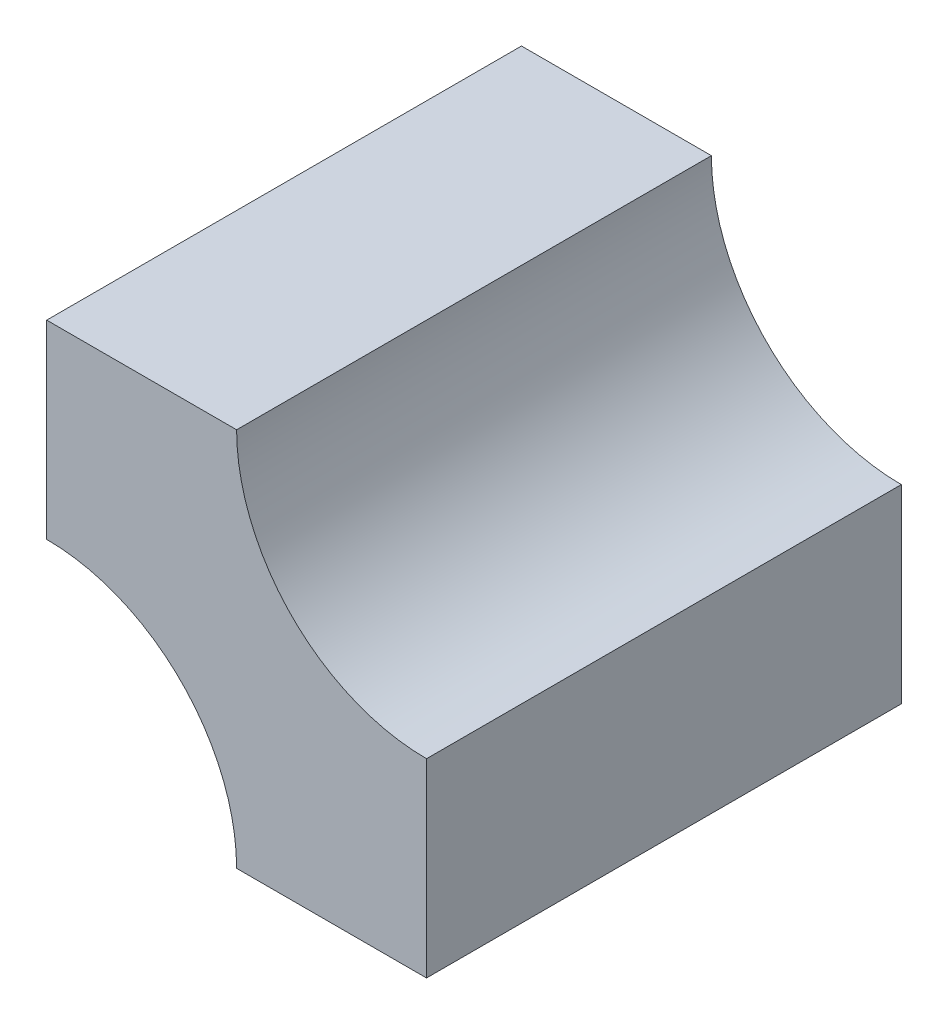
ISO-10303-21;
HEADER;
FILE_DESCRIPTION(('STEP AP214'),'2;1');
FILE_NAME('part.step','',(''),(''),'','','');
FILE_SCHEMA(('AUTOMOTIVE_DESIGN { 1 0 10303 214 1 1 1 1 }'));
ENDSEC;
DATA;
#1=APPLICATION_CONTEXT('core data for automotive mechanical design processes');
#2=APPLICATION_PROTOCOL_DEFINITION('international standard','automotive_design',2000,#1);
#3=PRODUCT_CONTEXT('',#1,'mechanical');
#4=PRODUCT('Part','Part','',(#3));
#5=PRODUCT_RELATED_PRODUCT_CATEGORY('part','',(#4));
#6=PRODUCT_DEFINITION_FORMATION('','',#4);
#7=PRODUCT_DEFINITION_CONTEXT('part definition',#1,'design');
#8=PRODUCT_DEFINITION('design','',#6,#7);
#9=PRODUCT_DEFINITION_SHAPE('','',#8);
#10=(LENGTH_UNIT() NAMED_UNIT(*) SI_UNIT(.MILLI.,.METRE.));
#11=(NAMED_UNIT(*) PLANE_ANGLE_UNIT() SI_UNIT($,.RADIAN.));
#12=(NAMED_UNIT(*) SI_UNIT($,.STERADIAN.) SOLID_ANGLE_UNIT());
#13=UNCERTAINTY_MEASURE_WITH_UNIT(LENGTH_MEASURE(1.E-05),#10,'distance_accuracy_value','');
#14=(GEOMETRIC_REPRESENTATION_CONTEXT(3) GLOBAL_UNCERTAINTY_ASSIGNED_CONTEXT((#13)) GLOBAL_UNIT_ASSIGNED_CONTEXT((#10,
#11,#12)) REPRESENTATION_CONTEXT('',''));
#15=CARTESIAN_POINT('',(0.,0.,0.));
#16=DIRECTION('',(0.,0.,1.));
#17=DIRECTION('',(1.,0.,0.));
#18=AXIS2_PLACEMENT_3D('',#15,#16,#17);
#19=CARTESIAN_POINT('',(-20.,0.,25.));
#20=DIRECTION('',(0.,0.,-1.));
#21=DIRECTION('',(-1.,0.,0.));
#22=AXIS2_PLACEMENT_3D('',#19,#20,#21);
#23=CYLINDRICAL_SURFACE('',#22,10.);
#24=CARTESIAN_POINT('',(-20.,0.,0.));
#25=DIRECTION('',(0.,0.,-1.));
#26=DIRECTION('',(1.,0.,0.));
#27=AXIS2_PLACEMENT_3D('',#24,#25,#26);
#28=CIRCLE('',#27,10.);
#29=CARTESIAN_POINT('',(-20.,10.,0.));
#30=VERTEX_POINT('',#29);
#31=CARTESIAN_POINT('',(-10.,0.,0.));
#32=VERTEX_POINT('',#31);
#33=EDGE_CURVE('E117',#30,#32,#28,.T.);
#34=ORIENTED_EDGE('',*,*,#33,.T.);
#35=DIRECTION('',(0.,0.,-1.));
#36=VECTOR('',#35,1.);
#37=CARTESIAN_POINT('',(-10.,0.,25.));
#38=LINE('',#37,#36);
#39=CARTESIAN_POINT('',(-10.,0.,25.));
#40=VERTEX_POINT('',#39);
#41=EDGE_CURVE('E11',#40,#32,#38,.T.);
#42=ORIENTED_EDGE('',*,*,#41,.F.);
#43=CARTESIAN_POINT('',(-20.,0.,25.));
#44=DIRECTION('',(0.,0.,-1.));
#45=DIRECTION('',(1.,0.,0.));
#46=AXIS2_PLACEMENT_3D('',#43,#44,#45);
#47=CIRCLE('',#46,10.);
#48=CARTESIAN_POINT('',(-20.,10.,25.));
#49=VERTEX_POINT('',#48);
#50=EDGE_CURVE('E127',#49,#40,#47,.T.);
#51=ORIENTED_EDGE('',*,*,#50,.F.);
#52=DIRECTION('',(0.,0.,-1.));
#53=VECTOR('',#52,1.);
#54=CARTESIAN_POINT('',(-20.,10.,25.));
#55=LINE('',#54,#53);
#56=EDGE_CURVE('E113',#49,#30,#55,.T.);
#57=ORIENTED_EDGE('',*,*,#56,.T.);
#58=EDGE_LOOP('',(#34,#42,#51,#57));
#59=FACE_BOUND('',#58,.T.);
#60=ADVANCED_FACE('F33',(#59),#23,.F.);
#61=CARTESIAN_POINT('',(0.,0.,25.));
#62=DIRECTION('',(0.,1.,0.));
#63=DIRECTION('',(-1.,0.,0.));
#64=AXIS2_PLACEMENT_3D('',#61,#62,#63);
#65=PLANE('',#64);
#66=DIRECTION('',(1.,0.,0.));
#67=VECTOR('',#66,1.);
#68=CARTESIAN_POINT('',(0.,0.,0.));
#69=LINE('',#68,#67);
#70=CARTESIAN_POINT('',(0.,0.,0.));
#71=VERTEX_POINT('',#70);
#72=EDGE_CURVE('E120',#32,#71,#69,.T.);
#73=ORIENTED_EDGE('',*,*,#72,.T.);
#74=DIRECTION('',(0.,0.,-1.));
#75=VECTOR('',#74,1.);
#76=CARTESIAN_POINT('',(0.,0.,25.));
#77=LINE('',#76,#75);
#78=CARTESIAN_POINT('',(0.,0.,25.));
#79=VERTEX_POINT('',#78);
#80=EDGE_CURVE('E41',#79,#71,#77,.T.);
#81=ORIENTED_EDGE('',*,*,#80,.F.);
#82=DIRECTION('',(1.,0.,0.));
#83=VECTOR('',#82,1.);
#84=CARTESIAN_POINT('',(0.,0.,25.));
#85=LINE('',#84,#83);
#86=EDGE_CURVE('E86',#40,#79,#85,.T.);
#87=ORIENTED_EDGE('',*,*,#86,.F.);
#88=ORIENTED_EDGE('',*,*,#41,.T.);
#89=EDGE_LOOP('',(#73,#81,#87,#88));
#90=FACE_BOUND('',#89,.T.);
#91=ADVANCED_FACE('F151',(#90),#65,.F.);
#92=CARTESIAN_POINT('',(0.,10.,25.));
#93=DIRECTION('',(-1.,0.,0.));
#94=DIRECTION('',(0.,0.,1.));
#95=AXIS2_PLACEMENT_3D('',#92,#93,#94);
#96=PLANE('',#95);
#97=DIRECTION('',(0.,1.,0.));
#98=VECTOR('',#97,1.);
#99=CARTESIAN_POINT('',(0.,10.,0.));
#100=LINE('',#99,#98);
#101=CARTESIAN_POINT('',(0.,10.,0.));
#102=VERTEX_POINT('',#101);
#103=EDGE_CURVE('E122',#71,#102,#100,.T.);
#104=ORIENTED_EDGE('',*,*,#103,.T.);
#105=DIRECTION('',(0.,0.,-1.));
#106=VECTOR('',#105,1.);
#107=CARTESIAN_POINT('',(0.,10.,25.));
#108=LINE('',#107,#106);
#109=CARTESIAN_POINT('',(0.,10.,25.));
#110=VERTEX_POINT('',#109);
#111=EDGE_CURVE('E108',#110,#102,#108,.T.);
#112=ORIENTED_EDGE('',*,*,#111,.F.);
#113=DIRECTION('',(0.,1.,0.));
#114=VECTOR('',#113,1.);
#115=CARTESIAN_POINT('',(0.,10.,25.));
#116=LINE('',#115,#114);
#117=EDGE_CURVE('E99',#79,#110,#116,.T.);
#118=ORIENTED_EDGE('',*,*,#117,.F.);
#119=ORIENTED_EDGE('',*,*,#80,.T.);
#120=EDGE_LOOP('',(#104,#112,#118,#119));
#121=FACE_BOUND('',#120,.T.);
#122=ADVANCED_FACE('F133',(#121),#96,.F.);
#123=CARTESIAN_POINT('',(0.,20.,25.));
#124=DIRECTION('',(0.,0.,-1.));
#125=DIRECTION('',(-1.,0.,0.));
#126=AXIS2_PLACEMENT_3D('',#123,#124,#125);
#127=CYLINDRICAL_SURFACE('',#126,10.);
#128=CARTESIAN_POINT('',(0.,20.,0.));
#129=DIRECTION('',(0.,0.,-1.));
#130=DIRECTION('',(1.,0.,0.));
#131=AXIS2_PLACEMENT_3D('',#128,#129,#130);
#132=CIRCLE('',#131,10.);
#133=CARTESIAN_POINT('',(-10.,20.,0.));
#134=VERTEX_POINT('',#133);
#135=EDGE_CURVE('E107',#102,#134,#132,.T.);
#136=ORIENTED_EDGE('',*,*,#135,.T.);
#137=DIRECTION('',(0.,0.,-1.));
#138=VECTOR('',#137,1.);
#139=CARTESIAN_POINT('',(-10.,20.,25.));
#140=LINE('',#139,#138);
#141=CARTESIAN_POINT('',(-10.,20.,25.));
#142=VERTEX_POINT('',#141);
#143=EDGE_CURVE('E104',#142,#134,#140,.T.);
#144=ORIENTED_EDGE('',*,*,#143,.F.);
#145=CARTESIAN_POINT('',(0.,20.,25.));
#146=DIRECTION('',(0.,0.,-1.));
#147=DIRECTION('',(1.,0.,0.));
#148=AXIS2_PLACEMENT_3D('',#145,#146,#147);
#149=CIRCLE('',#148,10.);
#150=EDGE_CURVE('E93',#110,#142,#149,.T.);
#151=ORIENTED_EDGE('',*,*,#150,.F.);
#152=ORIENTED_EDGE('',*,*,#111,.T.);
#153=EDGE_LOOP('',(#136,#144,#151,#152));
#154=FACE_BOUND('',#153,.T.);
#155=ADVANCED_FACE('F105',(#154),#127,.F.);
#156=CARTESIAN_POINT('',(-20.,20.,25.));
#157=DIRECTION('',(0.,-1.,0.));
#158=DIRECTION('',(1.,0.,0.));
#159=AXIS2_PLACEMENT_3D('',#156,#157,#158);
#160=PLANE('',#159);
#161=DIRECTION('',(-1.,0.,0.));
#162=VECTOR('',#161,1.);
#163=CARTESIAN_POINT('',(-20.,20.,0.));
#164=LINE('',#163,#162);
#165=CARTESIAN_POINT('',(-20.,20.,0.));
#166=VERTEX_POINT('',#165);
#167=EDGE_CURVE('E72',#134,#166,#164,.T.);
#168=ORIENTED_EDGE('',*,*,#167,.T.);
#169=DIRECTION('',(0.,0.,-1.));
#170=VECTOR('',#169,1.);
#171=CARTESIAN_POINT('',(-20.,20.,25.));
#172=LINE('',#171,#170);
#173=CARTESIAN_POINT('',(-20.,20.,25.));
#174=VERTEX_POINT('',#173);
#175=EDGE_CURVE('E109',#174,#166,#172,.T.);
#176=ORIENTED_EDGE('',*,*,#175,.F.);
#177=DIRECTION('',(-1.,0.,0.));
#178=VECTOR('',#177,1.);
#179=CARTESIAN_POINT('',(-20.,20.,25.));
#180=LINE('',#179,#178);
#181=EDGE_CURVE('E97',#142,#174,#180,.T.);
#182=ORIENTED_EDGE('',*,*,#181,.F.);
#183=ORIENTED_EDGE('',*,*,#143,.T.);
#184=EDGE_LOOP('',(#168,#176,#182,#183));
#185=FACE_BOUND('',#184,.T.);
#186=ADVANCED_FACE('F111',(#185),#160,.F.);
#187=CARTESIAN_POINT('',(-20.,10.,25.));
#188=DIRECTION('',(1.,0.,0.));
#189=DIRECTION('',(0.,0.,-1.));
#190=AXIS2_PLACEMENT_3D('',#187,#188,#189);
#191=PLANE('',#190);
#192=DIRECTION('',(0.,-1.,0.));
#193=VECTOR('',#192,1.);
#194=CARTESIAN_POINT('',(-20.,10.,0.));
#195=LINE('',#194,#193);
#196=EDGE_CURVE('E78',#166,#30,#195,.T.);
#197=ORIENTED_EDGE('',*,*,#196,.T.);
#198=ORIENTED_EDGE('',*,*,#56,.F.);
#199=DIRECTION('',(0.,-1.,0.));
#200=VECTOR('',#199,1.);
#201=CARTESIAN_POINT('',(-20.,10.,25.));
#202=LINE('',#201,#200);
#203=EDGE_CURVE('E49',#174,#49,#202,.T.);
#204=ORIENTED_EDGE('',*,*,#203,.F.);
#205=ORIENTED_EDGE('',*,*,#175,.T.);
#206=EDGE_LOOP('',(#197,#198,#204,#205));
#207=FACE_BOUND('',#206,.T.);
#208=ADVANCED_FACE('F140',(#207),#191,.F.);
#209=CARTESIAN_POINT('',(-20.,0.,25.));
#210=DIRECTION('',(0.,0.,1.));
#211=DIRECTION('',(1.,0.,0.));
#212=AXIS2_PLACEMENT_3D('',#209,#210,#211);
#213=PLANE('',#212);
#214=ORIENTED_EDGE('',*,*,#50,.T.);
#215=ORIENTED_EDGE('',*,*,#86,.T.);
#216=ORIENTED_EDGE('',*,*,#117,.T.);
#217=ORIENTED_EDGE('',*,*,#150,.T.);
#218=ORIENTED_EDGE('',*,*,#181,.T.);
#219=ORIENTED_EDGE('',*,*,#203,.T.);
#220=EDGE_LOOP('',(#214,#215,#216,#217,#218,#219));
#221=FACE_BOUND('',#220,.T.);
#222=ADVANCED_FACE('F95',(#221),#213,.T.);
#223=CARTESIAN_POINT('',(-20.,0.,0.));
#224=DIRECTION('',(0.,0.,1.));
#225=DIRECTION('',(1.,0.,0.));
#226=AXIS2_PLACEMENT_3D('',#223,#224,#225);
#227=PLANE('',#226);
#228=ORIENTED_EDGE('',*,*,#33,.F.);
#229=ORIENTED_EDGE('',*,*,#196,.F.);
#230=ORIENTED_EDGE('',*,*,#167,.F.);
#231=ORIENTED_EDGE('',*,*,#135,.F.);
#232=ORIENTED_EDGE('',*,*,#103,.F.);
#233=ORIENTED_EDGE('',*,*,#72,.F.);
#234=EDGE_LOOP('',(#228,#229,#230,#231,#232,#233));
#235=FACE_BOUND('',#234,.T.);
#236=ADVANCED_FACE('F136',(#235),#227,.F.);
#237=CLOSED_SHELL('',(#60,#91,#122,#155,#186,#208,#222,#236));
#238=MANIFOLD_SOLID_BREP('B2',#237);
#239=ADVANCED_BREP_SHAPE_REPRESENTATION('',(#18,#238),#14);
#240=SHAPE_DEFINITION_REPRESENTATION(#9,#239);
ENDSEC;
END-ISO-10303-21;
